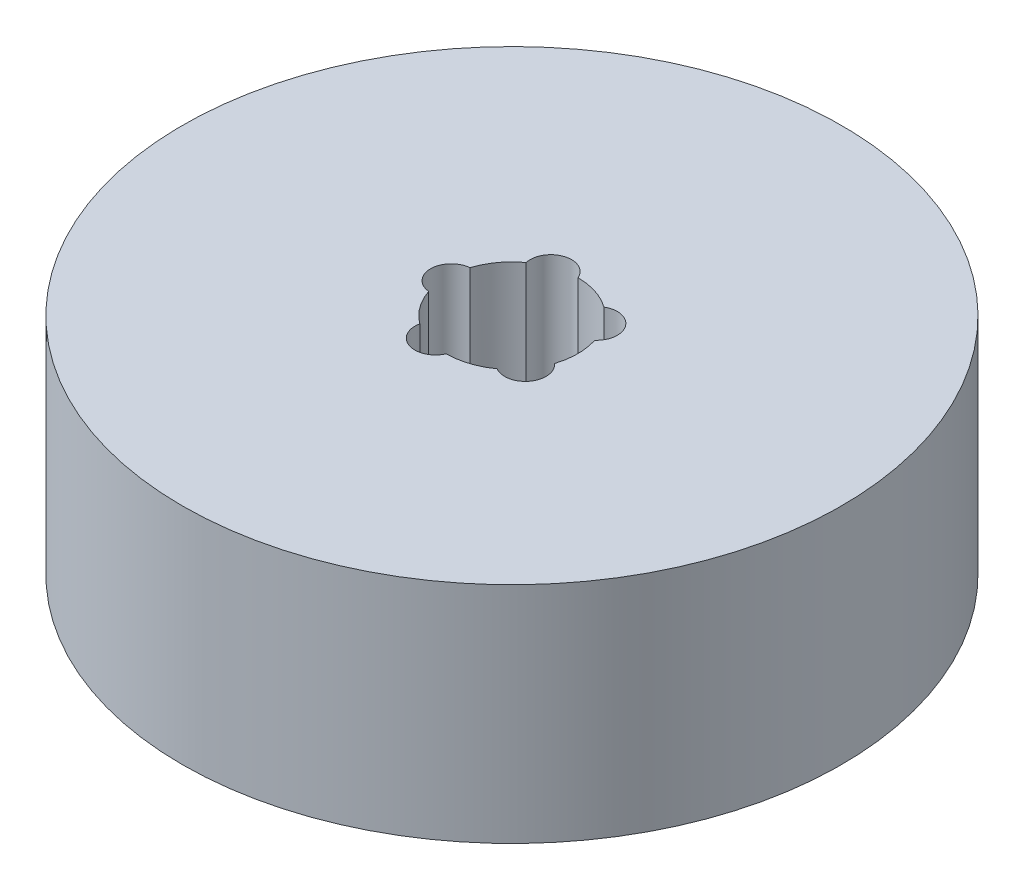
ISO-10303-21;
HEADER;
FILE_DESCRIPTION(('STEP AP214'),'2;1');
FILE_NAME('part.step','',(''),(''),'','','');
FILE_SCHEMA(('AUTOMOTIVE_DESIGN { 1 0 10303 214 1 1 1 1 }'));
ENDSEC;
DATA;
#1=APPLICATION_CONTEXT('core data for automotive mechanical design processes');
#2=APPLICATION_PROTOCOL_DEFINITION('international standard','automotive_design',2000,#1);
#3=PRODUCT_CONTEXT('',#1,'mechanical');
#4=PRODUCT('Part','Part','',(#3));
#5=PRODUCT_RELATED_PRODUCT_CATEGORY('part','',(#4));
#6=PRODUCT_DEFINITION_FORMATION('','',#4);
#7=PRODUCT_DEFINITION_CONTEXT('part definition',#1,'design');
#8=PRODUCT_DEFINITION('design','',#6,#7);
#9=PRODUCT_DEFINITION_SHAPE('','',#8);
#10=(LENGTH_UNIT() NAMED_UNIT(*) SI_UNIT(.MILLI.,.METRE.));
#11=(NAMED_UNIT(*) PLANE_ANGLE_UNIT() SI_UNIT($,.RADIAN.));
#12=(NAMED_UNIT(*) SI_UNIT($,.STERADIAN.) SOLID_ANGLE_UNIT());
#13=UNCERTAINTY_MEASURE_WITH_UNIT(LENGTH_MEASURE(1.E-05),#10,'distance_accuracy_value','');
#14=(GEOMETRIC_REPRESENTATION_CONTEXT(3) GLOBAL_UNCERTAINTY_ASSIGNED_CONTEXT((#13)) GLOBAL_UNIT_ASSIGNED_CONTEXT((#10,
#11,#12)) REPRESENTATION_CONTEXT('',''));
#15=CARTESIAN_POINT('',(0.,0.,0.));
#16=DIRECTION('',(0.,0.,1.));
#17=DIRECTION('',(1.,0.,0.));
#18=AXIS2_PLACEMENT_3D('',#15,#16,#17);
#19=CARTESIAN_POINT('',(0.,17.,0.));
#20=DIRECTION('',(0.,-1.,0.));
#21=DIRECTION('',(0.,0.,-1.));
#22=AXIS2_PLACEMENT_3D('',#19,#20,#21);
#23=CYLINDRICAL_SURFACE('',#22,25.);
#24=CARTESIAN_POINT('',(0.,17.,0.));
#25=DIRECTION('',(0.,1.,0.));
#26=DIRECTION('',(0.,0.,1.));
#27=AXIS2_PLACEMENT_3D('',#24,#25,#26);
#28=CIRCLE('',#27,25.);
#29=CARTESIAN_POINT('',(0.,17.,25.));
#30=VERTEX_POINT('',#29);
#31=EDGE_CURVE('E151',#30,#30,#28,.T.);
#32=ORIENTED_EDGE('',*,*,#31,.F.);
#33=EDGE_LOOP('',(#32));
#34=FACE_BOUND('',#33,.T.);
#35=CARTESIAN_POINT('',(0.,0.,0.));
#36=DIRECTION('',(0.,1.,0.));
#37=DIRECTION('',(0.,0.,1.));
#38=AXIS2_PLACEMENT_3D('',#35,#36,#37);
#39=CIRCLE('',#38,25.);
#40=CARTESIAN_POINT('',(0.,0.,25.));
#41=VERTEX_POINT('',#40);
#42=EDGE_CURVE('E150',#41,#41,#39,.T.);
#43=ORIENTED_EDGE('',*,*,#42,.T.);
#44=EDGE_LOOP('',(#43));
#45=FACE_BOUND('',#44,.T.);
#46=ADVANCED_FACE('F39',(#34,#45),#23,.T.);
#47=CARTESIAN_POINT('',(0.,17.,0.));
#48=DIRECTION('',(0.,1.,0.));
#49=DIRECTION('',(0.,0.,1.));
#50=AXIS2_PLACEMENT_3D('',#47,#48,#49);
#51=PLANE('',#50);
#52=CARTESIAN_POINT('',(-1.42141400046732,17.,-4.37466246874851));
#53=DIRECTION('',(0.,1.,0.));
#54=DIRECTION('',(-0.95105651629515,0.,0.309016994374958));
#55=AXIS2_PLACEMENT_3D('',#52,#53,#54);
#56=CIRCLE('',#55,1.56960726858341);
#57=CARTESIAN_POINT('',(0.0182601467806974,17.,-4.99996665659278));
#58=VERTEX_POINT('',#57);
#59=CARTESIAN_POINT('',(-2.9536794317648,17.,-4.03432495150919));
#60=VERTEX_POINT('',#59);
#61=EDGE_CURVE('E196',#58,#60,#56,.T.);
#62=ORIENTED_EDGE('',*,*,#61,.F.);
#63=CARTESIAN_POINT('',(0.,17.,0.));
#64=DIRECTION('',(0.,1.,0.));
#65=DIRECTION('',(0.,0.,1.));
#66=AXIS2_PLACEMENT_3D('',#63,#64,#65);
#67=CIRCLE('',#66,5.);
#68=CARTESIAN_POINT('',(2.92413389363389,17.,-4.05579104147409));
#69=VERTEX_POINT('',#68);
#70=EDGE_CURVE('E156',#69,#58,#67,.T.);
#71=ORIENTED_EDGE('',*,*,#70,.F.);
#72=CARTESIAN_POINT('',(3.72131016530824,17.,-2.70369009499515));
#73=DIRECTION('',(0.,1.,0.));
#74=DIRECTION('',(-0.58778525229248,0.,-0.809016994374942));
#75=AXIS2_PLACEMENT_3D('',#72,#73,#74);
#76=CIRCLE('',#75,1.56960726858341);
#77=CARTESIAN_POINT('',(4.76089356568607,17.,-1.52770823661095));
#78=VERTEX_POINT('',#77);
#79=EDGE_CURVE('E254',#78,#69,#76,.T.);
#80=ORIENTED_EDGE('',*,*,#79,.F.);
#81=CARTESIAN_POINT('',(4.7608935656861,17.,1.52770823661089));
#82=VERTEX_POINT('',#81);
#83=EDGE_CURVE('E153',#82,#78,#67,.T.);
#84=ORIENTED_EDGE('',*,*,#83,.F.);
#85=CARTESIAN_POINT('',(3.72131016530828,17.,2.70369009499509));
#86=DIRECTION('',(0.,1.,0.));
#87=DIRECTION('',(0.587785252292469,0.,-0.809016994374951));
#88=AXIS2_PLACEMENT_3D('',#85,#86,#87);
#89=CIRCLE('',#88,1.56960726858341);
#90=CARTESIAN_POINT('',(2.92413389363395,17.,4.05579104147405));
#91=VERTEX_POINT('',#90);
#92=EDGE_CURVE('E248',#91,#82,#89,.T.);
#93=ORIENTED_EDGE('',*,*,#92,.F.);
#94=CARTESIAN_POINT('',(0.0182601467807685,17.,4.99996665659278));
#95=VERTEX_POINT('',#94);
#96=EDGE_CURVE('E140',#95,#91,#67,.T.);
#97=ORIENTED_EDGE('',*,*,#96,.F.);
#98=CARTESIAN_POINT('',(-1.42141400046725,17.,4.37466246874853));
#99=DIRECTION('',(0.,1.,0.));
#100=DIRECTION('',(0.951056516295155,0.,0.309016994374945));
#101=AXIS2_PLACEMENT_3D('',#98,#99,#100);
#102=CIRCLE('',#101,1.56960726858341);
#103=CARTESIAN_POINT('',(-2.95367943176474,17.,4.03432495150923));
#104=VERTEX_POINT('',#103);
#105=EDGE_CURVE('E117',#104,#95,#102,.T.);
#106=ORIENTED_EDGE('',*,*,#105,.F.);
#107=CARTESIAN_POINT('',(-4.74960817433602,17.,1.5624410997796));
#108=VERTEX_POINT('',#107);
#109=EDGE_CURVE('E133',#108,#104,#67,.T.);
#110=ORIENTED_EDGE('',*,*,#109,.F.);
#111=CARTESIAN_POINT('',(-4.59979232968199,17.,0.));
#112=DIRECTION('',(0.,1.,0.));
#113=DIRECTION('',(0.,0.,1.));
#114=AXIS2_PLACEMENT_3D('',#111,#112,#113);
#115=CIRCLE('',#114,1.56960726858341);
#116=CARTESIAN_POINT('',(-4.74960817433602,17.,-1.5624410997796));
#117=VERTEX_POINT('',#116);
#118=EDGE_CURVE('E170',#117,#108,#115,.T.);
#119=ORIENTED_EDGE('',*,*,#118,.F.);
#120=EDGE_CURVE('E149',#60,#117,#67,.T.);
#121=ORIENTED_EDGE('',*,*,#120,.F.);
#122=EDGE_LOOP('',(#62,#71,#80,#84,#93,#97,#106,#110,#119,#121));
#123=FACE_BOUND('',#122,.T.);
#124=ORIENTED_EDGE('',*,*,#31,.T.);
#125=EDGE_LOOP('',(#124));
#126=FACE_BOUND('',#125,.T.);
#127=ADVANCED_FACE('F131',(#123,#126),#51,.T.);
#128=CARTESIAN_POINT('',(0.,0.,0.));
#129=DIRECTION('',(0.,1.,0.));
#130=DIRECTION('',(0.,0.,1.));
#131=AXIS2_PLACEMENT_3D('',#128,#129,#130);
#132=PLANE('',#131);
#133=CARTESIAN_POINT('',(0.,0.,0.));
#134=DIRECTION('',(0.,1.,0.));
#135=DIRECTION('',(0.,0.,1.));
#136=AXIS2_PLACEMENT_3D('',#133,#134,#135);
#137=CIRCLE('',#136,5.);
#138=CARTESIAN_POINT('',(0.,0.,5.));
#139=VERTEX_POINT('',#138);
#140=EDGE_CURVE('E160',#139,#139,#137,.T.);
#141=ORIENTED_EDGE('',*,*,#140,.T.);
#142=EDGE_LOOP('',(#141));
#143=FACE_BOUND('',#142,.T.);
#144=ORIENTED_EDGE('',*,*,#42,.F.);
#145=EDGE_LOOP('',(#144));
#146=FACE_BOUND('',#145,.T.);
#147=ADVANCED_FACE('F212',(#143,#146),#132,.F.);
#148=CARTESIAN_POINT('',(0.,17.,0.));
#149=DIRECTION('',(0.,-1.,0.));
#150=DIRECTION('',(0.,0.,-1.));
#151=AXIS2_PLACEMENT_3D('',#148,#149,#150);
#152=CYLINDRICAL_SURFACE('',#151,5.);
#153=DIRECTION('',(0.,1.,0.));
#154=VECTOR('',#153,1.);
#155=CARTESIAN_POINT('',(0.0182601467806974,11.2574819534992,-4.99996665659278));
#156=LINE('',#155,#154);
#157=CARTESIAN_POINT('',(0.0182601467806974,5.51496390699841,-4.99996665659278));
#158=VERTEX_POINT('',#157);
#159=EDGE_CURVE('E11',#158,#58,#156,.T.);
#160=ORIENTED_EDGE('',*,*,#159,.F.);
#161=CARTESIAN_POINT('',(0.,5.51496390699841,0.));
#162=DIRECTION('',(0.,1.,0.));
#163=DIRECTION('',(0.,0.,1.));
#164=AXIS2_PLACEMENT_3D('',#161,#162,#163);
#165=CIRCLE('',#164,5.);
#166=CARTESIAN_POINT('',(-2.9536794317648,5.51496390699841,-4.03432495150919));
#167=VERTEX_POINT('',#166);
#168=EDGE_CURVE('E193',#158,#167,#165,.T.);
#169=ORIENTED_EDGE('',*,*,#168,.T.);
#170=DIRECTION('',(0.,1.,0.));
#171=VECTOR('',#170,1.);
#172=CARTESIAN_POINT('',(-2.9536794317648,11.2574819534992,-4.03432495150919));
#173=LINE('',#172,#171);
#174=EDGE_CURVE('E46',#60,#167,#173,.F.);
#175=ORIENTED_EDGE('',*,*,#174,.F.);
#176=ORIENTED_EDGE('',*,*,#120,.T.);
#177=DIRECTION('',(0.,1.,0.));
#178=VECTOR('',#177,1.);
#179=CARTESIAN_POINT('',(-4.74960817433602,11.2574819534992,-1.5624410997796));
#180=LINE('',#179,#178);
#181=CARTESIAN_POINT('',(-4.74960817433602,5.51496390699841,-1.5624410997796));
#182=VERTEX_POINT('',#181);
#183=EDGE_CURVE('E174',#182,#117,#180,.T.);
#184=ORIENTED_EDGE('',*,*,#183,.F.);
#185=CARTESIAN_POINT('',(0.,5.51496390699841,0.));
#186=DIRECTION('',(0.,1.,0.));
#187=DIRECTION('',(0.,0.,1.));
#188=AXIS2_PLACEMENT_3D('',#185,#186,#187);
#189=CIRCLE('',#188,5.);
#190=CARTESIAN_POINT('',(-4.74960817433602,5.51496390699841,1.5624410997796));
#191=VERTEX_POINT('',#190);
#192=EDGE_CURVE('E171',#182,#191,#189,.T.);
#193=ORIENTED_EDGE('',*,*,#192,.T.);
#194=DIRECTION('',(0.,1.,0.));
#195=VECTOR('',#194,1.);
#196=CARTESIAN_POINT('',(-4.74960817433602,11.2574819534992,1.5624410997796));
#197=LINE('',#196,#195);
#198=EDGE_CURVE('E148',#108,#191,#197,.F.);
#199=ORIENTED_EDGE('',*,*,#198,.F.);
#200=ORIENTED_EDGE('',*,*,#109,.T.);
#201=DIRECTION('',(0.,1.,0.));
#202=VECTOR('',#201,1.);
#203=CARTESIAN_POINT('',(-2.95367943176474,11.2574819534992,4.03432495150923));
#204=LINE('',#203,#202);
#205=CARTESIAN_POINT('',(-2.95367943176474,5.51496390699841,4.03432495150923));
#206=VERTEX_POINT('',#205);
#207=EDGE_CURVE('E111',#206,#104,#204,.T.);
#208=ORIENTED_EDGE('',*,*,#207,.F.);
#209=CARTESIAN_POINT('',(0.,5.51496390699841,0.));
#210=DIRECTION('',(0.,1.,0.));
#211=DIRECTION('',(0.,0.,1.));
#212=AXIS2_PLACEMENT_3D('',#209,#210,#211);
#213=CIRCLE('',#212,5.);
#214=CARTESIAN_POINT('',(0.0182601467807685,5.51496390699841,4.99996665659278));
#215=VERTEX_POINT('',#214);
#216=EDGE_CURVE('E180',#206,#215,#213,.T.);
#217=ORIENTED_EDGE('',*,*,#216,.T.);
#218=DIRECTION('',(0.,1.,0.));
#219=VECTOR('',#218,1.);
#220=CARTESIAN_POINT('',(0.0182601467807683,11.2574819534992,4.99996665659278));
#221=LINE('',#220,#219);
#222=EDGE_CURVE('E124',#95,#215,#221,.F.);
#223=ORIENTED_EDGE('',*,*,#222,.F.);
#224=ORIENTED_EDGE('',*,*,#96,.T.);
#225=DIRECTION('',(0.,1.,0.));
#226=VECTOR('',#225,1.);
#227=CARTESIAN_POINT('',(2.92413389363395,11.2574819534992,4.05579104147405));
#228=LINE('',#227,#226);
#229=CARTESIAN_POINT('',(2.92413389363395,5.51496390699841,4.05579104147405));
#230=VERTEX_POINT('',#229);
#231=EDGE_CURVE('E183',#230,#91,#228,.T.);
#232=ORIENTED_EDGE('',*,*,#231,.F.);
#233=CARTESIAN_POINT('',(0.,5.51496390699841,0.));
#234=DIRECTION('',(0.,1.,0.));
#235=DIRECTION('',(0.,0.,1.));
#236=AXIS2_PLACEMENT_3D('',#233,#234,#235);
#237=CIRCLE('',#236,5.);
#238=CARTESIAN_POINT('',(4.7608935656861,5.51496390699841,1.52770823661089));
#239=VERTEX_POINT('',#238);
#240=EDGE_CURVE('E123',#230,#239,#237,.T.);
#241=ORIENTED_EDGE('',*,*,#240,.T.);
#242=DIRECTION('',(0.,1.,0.));
#243=VECTOR('',#242,1.);
#244=CARTESIAN_POINT('',(4.7608935656861,11.2574819534992,1.52770823661089));
#245=LINE('',#244,#243);
#246=EDGE_CURVE('E185',#82,#239,#245,.F.);
#247=ORIENTED_EDGE('',*,*,#246,.F.);
#248=ORIENTED_EDGE('',*,*,#83,.T.);
#249=DIRECTION('',(0.,1.,0.));
#250=VECTOR('',#249,1.);
#251=CARTESIAN_POINT('',(4.76089356568607,11.2574819534992,-1.52770823661095));
#252=LINE('',#251,#250);
#253=CARTESIAN_POINT('',(4.76089356568607,5.51496390699841,-1.52770823661095));
#254=VERTEX_POINT('',#253);
#255=EDGE_CURVE('E195',#254,#78,#252,.T.);
#256=ORIENTED_EDGE('',*,*,#255,.F.);
#257=CARTESIAN_POINT('',(0.,5.51496390699841,0.));
#258=DIRECTION('',(0.,1.,0.));
#259=DIRECTION('',(0.,0.,1.));
#260=AXIS2_PLACEMENT_3D('',#257,#258,#259);
#261=CIRCLE('',#260,5.);
#262=CARTESIAN_POINT('',(2.92413389363389,5.51496390699841,-4.05579104147409));
#263=VERTEX_POINT('',#262);
#264=EDGE_CURVE('E190',#254,#263,#261,.T.);
#265=ORIENTED_EDGE('',*,*,#264,.T.);
#266=DIRECTION('',(0.,1.,0.));
#267=VECTOR('',#266,1.);
#268=CARTESIAN_POINT('',(2.92413389363389,11.2574819534992,-4.05579104147409));
#269=LINE('',#268,#267);
#270=EDGE_CURVE('E189',#69,#263,#269,.F.);
#271=ORIENTED_EDGE('',*,*,#270,.F.);
#272=ORIENTED_EDGE('',*,*,#70,.T.);
#273=EDGE_LOOP('',(#160,#169,#175,#176,#184,#193,#199,#200,#208,#217,#223,#224,#232,#241,#247,
#248,#256,#265,#271,#272));
#274=FACE_BOUND('',#273,.T.);
#275=ORIENTED_EDGE('',*,*,#140,.F.);
#276=EDGE_LOOP('',(#275));
#277=FACE_BOUND('',#276,.T.);
#278=ADVANCED_FACE('F142',(#274,#277),#152,.F.);
#279=CARTESIAN_POINT('',(-4.59979232968199,5.51496390699841,0.));
#280=DIRECTION('',(0.,1.,0.));
#281=DIRECTION('',(0.,0.,1.));
#282=AXIS2_PLACEMENT_3D('',#279,#280,#281);
#283=CYLINDRICAL_SURFACE('',#282,1.56960726858341);
#284=ORIENTED_EDGE('',*,*,#183,.T.);
#285=ORIENTED_EDGE('',*,*,#118,.T.);
#286=ORIENTED_EDGE('',*,*,#198,.T.);
#287=CARTESIAN_POINT('',(-4.59979232968199,5.51496390699841,0.));
#288=DIRECTION('',(0.,1.,0.));
#289=DIRECTION('',(0.,0.,1.));
#290=AXIS2_PLACEMENT_3D('',#287,#288,#289);
#291=CIRCLE('',#290,1.56960726858341);
#292=EDGE_CURVE('E163',#182,#191,#291,.T.);
#293=ORIENTED_EDGE('',*,*,#292,.F.);
#294=EDGE_LOOP('',(#284,#285,#286,#293));
#295=FACE_BOUND('',#294,.T.);
#296=ADVANCED_FACE('F221',(#295),#283,.F.);
#297=CARTESIAN_POINT('',(-4.59979232968199,5.51496390699841,0.));
#298=DIRECTION('',(0.,1.,0.));
#299=DIRECTION('',(0.,0.,1.));
#300=AXIS2_PLACEMENT_3D('',#297,#298,#299);
#301=PLANE('',#300);
#302=ORIENTED_EDGE('',*,*,#292,.T.);
#303=ORIENTED_EDGE('',*,*,#192,.F.);
#304=EDGE_LOOP('',(#302,#303));
#305=FACE_BOUND('',#304,.T.);
#306=ADVANCED_FACE('F227',(#305),#301,.T.);
#307=CARTESIAN_POINT('',(-1.42141400046725,5.51496390699841,4.37466246874853));
#308=DIRECTION('',(0.,1.,0.));
#309=DIRECTION('',(0.,0.,1.));
#310=AXIS2_PLACEMENT_3D('',#307,#308,#309);
#311=CYLINDRICAL_SURFACE('',#310,1.56960726858341);
#312=ORIENTED_EDGE('',*,*,#207,.T.);
#313=ORIENTED_EDGE('',*,*,#105,.T.);
#314=ORIENTED_EDGE('',*,*,#222,.T.);
#315=CARTESIAN_POINT('',(-1.42141400046725,5.51496390699841,4.37466246874853));
#316=DIRECTION('',(0.,1.,0.));
#317=DIRECTION('',(0.951056516295155,0.,0.309016994374945));
#318=AXIS2_PLACEMENT_3D('',#315,#316,#317);
#319=CIRCLE('',#318,1.56960726858341);
#320=EDGE_CURVE('E119',#206,#215,#319,.T.);
#321=ORIENTED_EDGE('',*,*,#320,.F.);
#322=EDGE_LOOP('',(#312,#313,#314,#321));
#323=FACE_BOUND('',#322,.T.);
#324=ADVANCED_FACE('F116',(#323),#311,.F.);
#325=CARTESIAN_POINT('',(-1.42141400046725,5.51496390699841,4.37466246874853));
#326=DIRECTION('',(0.,1.,0.));
#327=DIRECTION('',(0.951056516295155,0.,0.309016994374945));
#328=AXIS2_PLACEMENT_3D('',#325,#326,#327);
#329=PLANE('',#328);
#330=ORIENTED_EDGE('',*,*,#320,.T.);
#331=ORIENTED_EDGE('',*,*,#216,.F.);
#332=EDGE_LOOP('',(#330,#331));
#333=FACE_BOUND('',#332,.T.);
#334=ADVANCED_FACE('F234',(#333),#329,.T.);
#335=CARTESIAN_POINT('',(3.72131016530828,5.51496390699841,2.70369009499509));
#336=DIRECTION('',(0.,1.,0.));
#337=DIRECTION('',(0.,0.,1.));
#338=AXIS2_PLACEMENT_3D('',#335,#336,#337);
#339=CYLINDRICAL_SURFACE('',#338,1.56960726858341);
#340=ORIENTED_EDGE('',*,*,#231,.T.);
#341=ORIENTED_EDGE('',*,*,#92,.T.);
#342=ORIENTED_EDGE('',*,*,#246,.T.);
#343=CARTESIAN_POINT('',(3.72131016530828,5.51496390699841,2.70369009499509));
#344=DIRECTION('',(0.,1.,0.));
#345=DIRECTION('',(0.587785252292469,0.,-0.809016994374951));
#346=AXIS2_PLACEMENT_3D('',#343,#344,#345);
#347=CIRCLE('',#346,1.56960726858341);
#348=EDGE_CURVE('E137',#230,#239,#347,.T.);
#349=ORIENTED_EDGE('',*,*,#348,.F.);
#350=EDGE_LOOP('',(#340,#341,#342,#349));
#351=FACE_BOUND('',#350,.T.);
#352=ADVANCED_FACE('F240',(#351),#339,.F.);
#353=CARTESIAN_POINT('',(3.72131016530828,5.51496390699841,2.70369009499509));
#354=DIRECTION('',(0.,1.,0.));
#355=DIRECTION('',(0.587785252292469,0.,-0.809016994374951));
#356=AXIS2_PLACEMENT_3D('',#353,#354,#355);
#357=PLANE('',#356);
#358=ORIENTED_EDGE('',*,*,#348,.T.);
#359=ORIENTED_EDGE('',*,*,#240,.F.);
#360=EDGE_LOOP('',(#358,#359));
#361=FACE_BOUND('',#360,.T.);
#362=ADVANCED_FACE('F245',(#361),#357,.T.);
#363=CARTESIAN_POINT('',(3.72131016530824,5.51496390699841,-2.70369009499515));
#364=DIRECTION('',(0.,1.,0.));
#365=DIRECTION('',(0.,0.,1.));
#366=AXIS2_PLACEMENT_3D('',#363,#364,#365);
#367=CYLINDRICAL_SURFACE('',#366,1.56960726858341);
#368=ORIENTED_EDGE('',*,*,#255,.T.);
#369=ORIENTED_EDGE('',*,*,#79,.T.);
#370=ORIENTED_EDGE('',*,*,#270,.T.);
#371=CARTESIAN_POINT('',(3.72131016530824,5.51496390699841,-2.70369009499515));
#372=DIRECTION('',(0.,1.,0.));
#373=DIRECTION('',(-0.58778525229248,0.,-0.809016994374942));
#374=AXIS2_PLACEMENT_3D('',#371,#372,#373);
#375=CIRCLE('',#374,1.56960726858341);
#376=EDGE_CURVE('E56',#254,#263,#375,.T.);
#377=ORIENTED_EDGE('',*,*,#376,.F.);
#378=EDGE_LOOP('',(#368,#369,#370,#377));
#379=FACE_BOUND('',#378,.T.);
#380=ADVANCED_FACE('F264',(#379),#367,.F.);
#381=CARTESIAN_POINT('',(3.72131016530824,5.51496390699841,-2.70369009499515));
#382=DIRECTION('',(0.,1.,0.));
#383=DIRECTION('',(-0.58778525229248,0.,-0.809016994374942));
#384=AXIS2_PLACEMENT_3D('',#381,#382,#383);
#385=PLANE('',#384);
#386=ORIENTED_EDGE('',*,*,#376,.T.);
#387=ORIENTED_EDGE('',*,*,#264,.F.);
#388=EDGE_LOOP('',(#386,#387));
#389=FACE_BOUND('',#388,.T.);
#390=ADVANCED_FACE('F202',(#389),#385,.T.);
#391=CARTESIAN_POINT('',(-1.42141400046732,5.51496390699841,-4.37466246874851));
#392=DIRECTION('',(0.,1.,0.));
#393=DIRECTION('',(0.,0.,1.));
#394=AXIS2_PLACEMENT_3D('',#391,#392,#393);
#395=CYLINDRICAL_SURFACE('',#394,1.56960726858341);
#396=ORIENTED_EDGE('',*,*,#159,.T.);
#397=ORIENTED_EDGE('',*,*,#61,.T.);
#398=ORIENTED_EDGE('',*,*,#174,.T.);
#399=CARTESIAN_POINT('',(-1.42141400046732,5.51496390699841,-4.37466246874851));
#400=DIRECTION('',(0.,1.,0.));
#401=DIRECTION('',(-0.95105651629515,0.,0.309016994374958));
#402=AXIS2_PLACEMENT_3D('',#399,#400,#401);
#403=CIRCLE('',#402,1.56960726858341);
#404=EDGE_CURVE('E55',#158,#167,#403,.T.);
#405=ORIENTED_EDGE('',*,*,#404,.F.);
#406=EDGE_LOOP('',(#396,#397,#398,#405));
#407=FACE_BOUND('',#406,.T.);
#408=ADVANCED_FACE('F197',(#407),#395,.F.);
#409=CARTESIAN_POINT('',(-1.42141400046732,5.51496390699841,-4.37466246874851));
#410=DIRECTION('',(0.,1.,0.));
#411=DIRECTION('',(-0.95105651629515,0.,0.309016994374958));
#412=AXIS2_PLACEMENT_3D('',#409,#410,#411);
#413=PLANE('',#412);
#414=ORIENTED_EDGE('',*,*,#404,.T.);
#415=ORIENTED_EDGE('',*,*,#168,.F.);
#416=EDGE_LOOP('',(#414,#415));
#417=FACE_BOUND('',#416,.T.);
#418=ADVANCED_FACE('F200',(#417),#413,.T.);
#419=CLOSED_SHELL('',(#46,#127,#147,#278,#296,#306,#324,#334,#352,#362,#380,#390,#408,#418));
#420=MANIFOLD_SOLID_BREP('B2',#419);
#421=ADVANCED_BREP_SHAPE_REPRESENTATION('',(#18,#420),#14);
#422=SHAPE_DEFINITION_REPRESENTATION(#9,#421);
ENDSEC;
END-ISO-10303-21;
